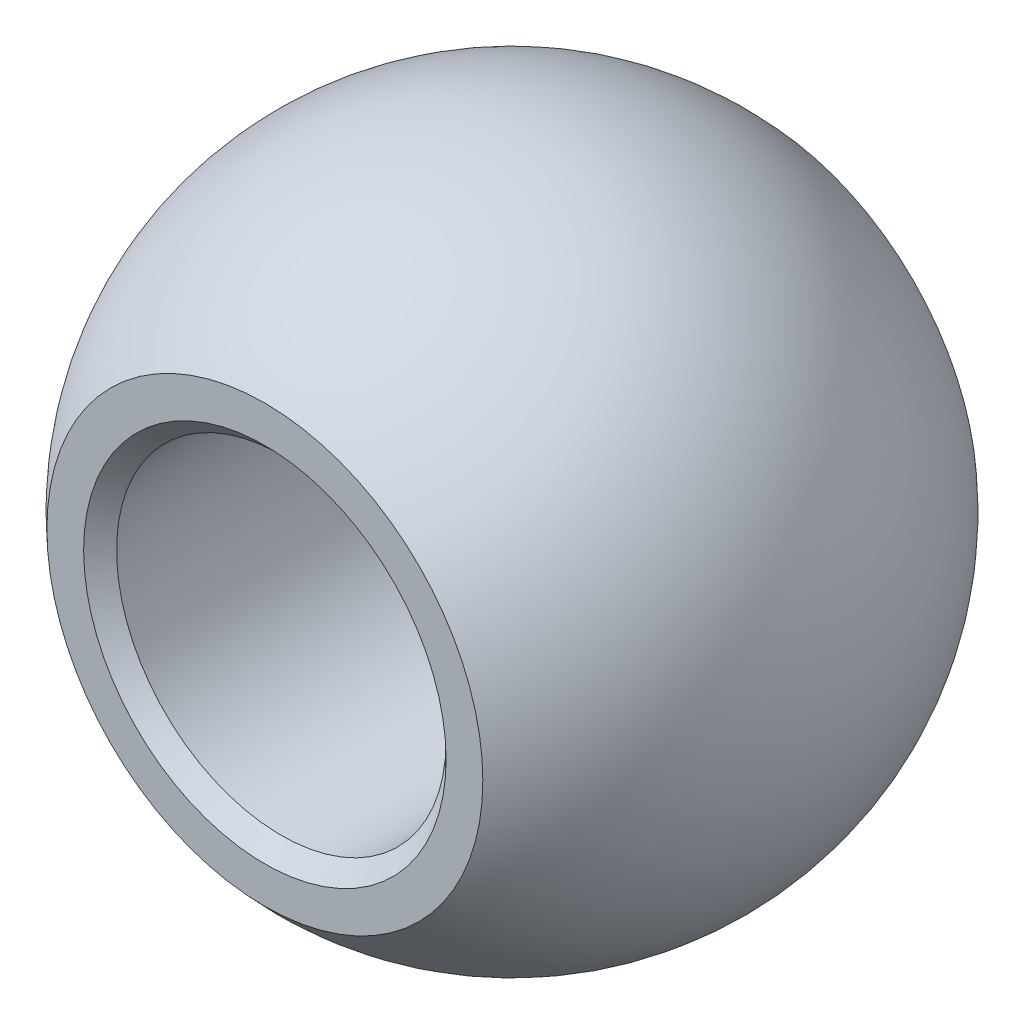
ISO-10303-21;
HEADER;
FILE_DESCRIPTION(('STEP AP214'),'2;1');
FILE_NAME('part.step','',(''),(''),'','','');
FILE_SCHEMA(('AUTOMOTIVE_DESIGN { 1 0 10303 214 1 1 1 1 }'));
ENDSEC;
DATA;
#1=APPLICATION_CONTEXT('core data for automotive mechanical design processes');
#2=APPLICATION_PROTOCOL_DEFINITION('international standard','automotive_design',2000,#1);
#3=PRODUCT_CONTEXT('',#1,'mechanical');
#4=PRODUCT('Part','Part','',(#3));
#5=PRODUCT_RELATED_PRODUCT_CATEGORY('part','',(#4));
#6=PRODUCT_DEFINITION_FORMATION('','',#4);
#7=PRODUCT_DEFINITION_CONTEXT('part definition',#1,'design');
#8=PRODUCT_DEFINITION('design','',#6,#7);
#9=PRODUCT_DEFINITION_SHAPE('','',#8);
#10=(LENGTH_UNIT() NAMED_UNIT(*) SI_UNIT(.MILLI.,.METRE.));
#11=(NAMED_UNIT(*) PLANE_ANGLE_UNIT() SI_UNIT($,.RADIAN.));
#12=(NAMED_UNIT(*) SI_UNIT($,.STERADIAN.) SOLID_ANGLE_UNIT());
#13=UNCERTAINTY_MEASURE_WITH_UNIT(LENGTH_MEASURE(1.E-05),#10,'distance_accuracy_value','');
#14=(GEOMETRIC_REPRESENTATION_CONTEXT(3) GLOBAL_UNCERTAINTY_ASSIGNED_CONTEXT((#13)) GLOBAL_UNIT_ASSIGNED_CONTEXT((#10,
#11,#12)) REPRESENTATION_CONTEXT('',''));
#15=CARTESIAN_POINT('',(0.,0.,0.));
#16=DIRECTION('',(0.,0.,1.));
#17=DIRECTION('',(1.,0.,0.));
#18=AXIS2_PLACEMENT_3D('',#15,#16,#17);
#19=CARTESIAN_POINT('',(0.,14.2875,0.));
#20=DIRECTION('',(0.,-1.,0.));
#21=DIRECTION('',(-1.,0.,0.));
#22=AXIS2_PLACEMENT_3D('',#19,#20,#21);
#23=SPHERICAL_SURFACE('',#22,6.35);
#24=CARTESIAN_POINT('',(0.,14.2875,0.));
#25=DIRECTION('',(0.,0.,1.));
#26=DIRECTION('',(1.,0.,0.));
#27=AXIS2_PLACEMENT_3D('',#24,#25,#26);
#28=SPHERICAL_SURFACE('',#27,6.35);
#29=CARTESIAN_POINT('',(0.,14.2875,-4.7625));
#30=DIRECTION('',(0.,0.,1.));
#31=DIRECTION('',(1.,0.,0.));
#32=AXIS2_PLACEMENT_3D('',#29,#30,#31);
#33=CIRCLE('',#32,4.20013020631503);
#34=CARTESIAN_POINT('',(4.20013020631503,14.2875,-4.7625));
#35=VERTEX_POINT('',#34);
#36=EDGE_CURVE('E56',#35,#35,#33,.F.);
#37=ORIENTED_EDGE('',*,*,#36,.F.);
#38=EDGE_LOOP('',(#37));
#39=FACE_BOUND('',#38,.T.);
#40=CARTESIAN_POINT('',(0.,14.2875,4.7625));
#41=DIRECTION('',(0.,0.,1.));
#42=DIRECTION('',(1.,0.,0.));
#43=AXIS2_PLACEMENT_3D('',#40,#41,#42);
#44=CIRCLE('',#43,4.20013020631504);
#45=CARTESIAN_POINT('',(4.20013020631504,14.2875,4.7625));
#46=VERTEX_POINT('',#45);
#47=EDGE_CURVE('E59',#46,#46,#44,.F.);
#48=ORIENTED_EDGE('',*,*,#47,.T.);
#49=EDGE_LOOP('',(#48));
#50=FACE_BOUND('',#49,.T.);
#51=ADVANCED_FACE('F36',(#39,#50),#28,.T.);
#52=CARTESIAN_POINT('',(0.,14.2875,-6.35));
#53=DIRECTION('',(0.,0.,1.));
#54=DIRECTION('',(1.,0.,0.));
#55=AXIS2_PLACEMENT_3D('',#52,#53,#54);
#56=CYLINDRICAL_SURFACE('',#55,3.175);
#57=CARTESIAN_POINT('',(0.,14.2875,-4.445));
#58=DIRECTION('',(0.,0.,1.));
#59=DIRECTION('',(1.,0.,0.));
#60=AXIS2_PLACEMENT_3D('',#57,#58,#59);
#61=CIRCLE('',#60,3.175);
#62=CARTESIAN_POINT('',(3.175,14.2875,-4.445));
#63=VERTEX_POINT('',#62);
#64=EDGE_CURVE('E47',#63,#63,#61,.F.);
#65=ORIENTED_EDGE('',*,*,#64,.T.);
#66=EDGE_LOOP('',(#65));
#67=FACE_BOUND('',#66,.T.);
#68=CARTESIAN_POINT('',(0.,14.2875,4.445));
#69=DIRECTION('',(0.,0.,1.));
#70=DIRECTION('',(1.,0.,0.));
#71=AXIS2_PLACEMENT_3D('',#68,#69,#70);
#72=CIRCLE('',#71,3.175);
#73=CARTESIAN_POINT('',(3.175,14.2875,4.445));
#74=VERTEX_POINT('',#73);
#75=EDGE_CURVE('E51',#74,#74,#72,.T.);
#76=ORIENTED_EDGE('',*,*,#75,.T.);
#77=EDGE_LOOP('',(#76));
#78=FACE_BOUND('',#77,.T.);
#79=ADVANCED_FACE('F74',(#67,#78),#56,.F.);
#80=CARTESIAN_POINT('',(0.,0.,-4.7625));
#81=DIRECTION('',(0.,0.,1.));
#82=DIRECTION('',(1.,0.,0.));
#83=AXIS2_PLACEMENT_3D('',#80,#81,#82);
#84=PLANE('',#83);
#85=CARTESIAN_POINT('',(0.,14.2875,-4.7625));
#86=DIRECTION('',(0.,0.,1.));
#87=DIRECTION('',(1.,0.,0.));
#88=AXIS2_PLACEMENT_3D('',#85,#86,#87);
#89=CIRCLE('',#88,3.4925);
#90=CARTESIAN_POINT('',(3.49250000000001,14.2875,-4.7625));
#91=VERTEX_POINT('',#90);
#92=EDGE_CURVE('E43',#91,#91,#89,.T.);
#93=ORIENTED_EDGE('',*,*,#92,.T.);
#94=EDGE_LOOP('',(#93));
#95=FACE_BOUND('',#94,.T.);
#96=ORIENTED_EDGE('',*,*,#36,.T.);
#97=EDGE_LOOP('',(#96));
#98=FACE_BOUND('',#97,.T.);
#99=ADVANCED_FACE('F67',(#95,#98),#84,.F.);
#100=CARTESIAN_POINT('',(0.,0.,4.7625));
#101=DIRECTION('',(0.,0.,1.));
#102=DIRECTION('',(1.,0.,0.));
#103=AXIS2_PLACEMENT_3D('',#100,#101,#102);
#104=PLANE('',#103);
#105=CARTESIAN_POINT('',(0.,14.2875,4.7625));
#106=DIRECTION('',(0.,0.,1.));
#107=DIRECTION('',(1.,0.,0.));
#108=AXIS2_PLACEMENT_3D('',#105,#106,#107);
#109=CIRCLE('',#108,3.4925);
#110=CARTESIAN_POINT('',(3.4925,14.2875,4.7625));
#111=VERTEX_POINT('',#110);
#112=EDGE_CURVE('E10',#111,#111,#109,.F.);
#113=ORIENTED_EDGE('',*,*,#112,.T.);
#114=EDGE_LOOP('',(#113));
#115=FACE_BOUND('',#114,.T.);
#116=ORIENTED_EDGE('',*,*,#47,.F.);
#117=EDGE_LOOP('',(#116));
#118=FACE_BOUND('',#117,.T.);
#119=ADVANCED_FACE('F64',(#115,#118),#104,.T.);
#120=CARTESIAN_POINT('',(0.,14.2875,-4.445));
#121=DIRECTION('',(0.,0.,-1.));
#122=DIRECTION('',(-1.,0.,0.));
#123=AXIS2_PLACEMENT_3D('',#120,#121,#122);
#124=CONICAL_SURFACE('',#123,3.175,0.785398163397453);
#125=ORIENTED_EDGE('',*,*,#92,.F.);
#126=EDGE_LOOP('',(#125));
#127=FACE_BOUND('',#126,.T.);
#128=ORIENTED_EDGE('',*,*,#64,.F.);
#129=EDGE_LOOP('',(#128));
#130=FACE_BOUND('',#129,.T.);
#131=ADVANCED_FACE('F66',(#127,#130),#124,.F.);
#132=CARTESIAN_POINT('',(0.,14.2875,4.7625));
#133=DIRECTION('',(0.,0.,1.));
#134=DIRECTION('',(1.,0.,0.));
#135=AXIS2_PLACEMENT_3D('',#132,#133,#134);
#136=CONICAL_SURFACE('',#135,3.4925,0.785398163397446);
#137=ORIENTED_EDGE('',*,*,#75,.F.);
#138=EDGE_LOOP('',(#137));
#139=FACE_BOUND('',#138,.T.);
#140=ORIENTED_EDGE('',*,*,#112,.F.);
#141=EDGE_LOOP('',(#140));
#142=FACE_BOUND('',#141,.T.);
#143=ADVANCED_FACE('F38',(#139,#142),#136,.F.);
#144=CLOSED_SHELL('',(#51,#79,#99,#119,#131,#143));
#145=MANIFOLD_SOLID_BREP('B2',#144);
#146=ADVANCED_BREP_SHAPE_REPRESENTATION('',(#18,#145),#14);
#147=SHAPE_DEFINITION_REPRESENTATION(#9,#146);
ENDSEC;
END-ISO-10303-21;
